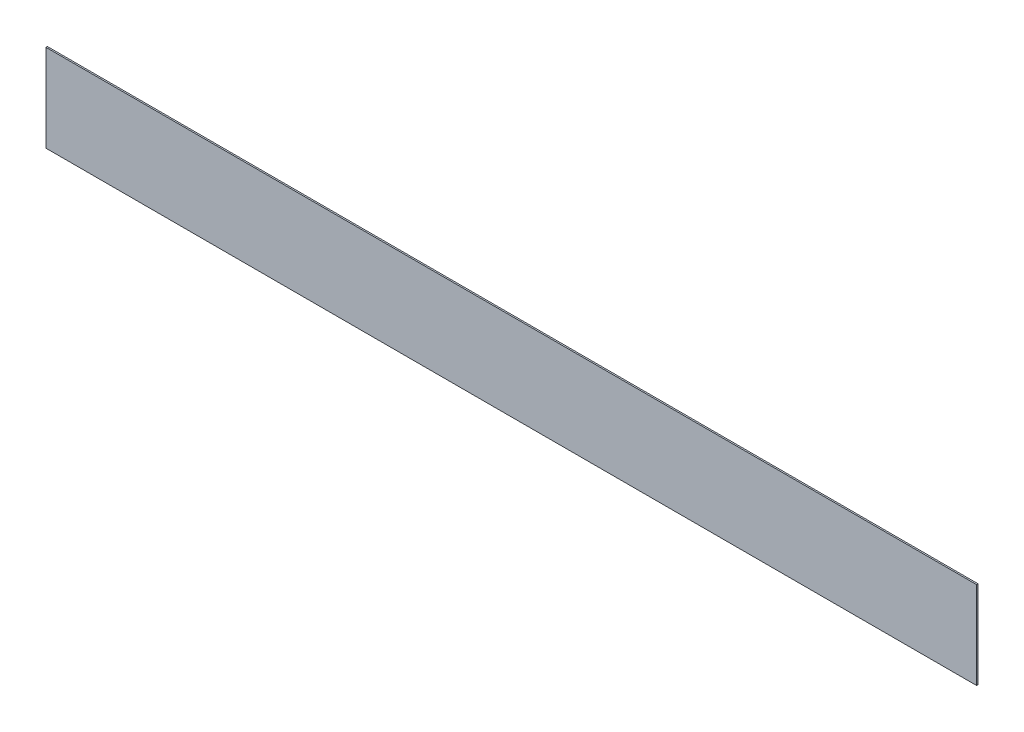
ISO-10303-21;
HEADER;
FILE_DESCRIPTION(('STEP AP214'),'2;1');
FILE_NAME('part.step','',(''),(''),'','','');
FILE_SCHEMA(('AUTOMOTIVE_DESIGN { 1 0 10303 214 1 1 1 1 }'));
ENDSEC;
DATA;
#1=APPLICATION_CONTEXT('core data for automotive mechanical design processes');
#2=APPLICATION_PROTOCOL_DEFINITION('international standard','automotive_design',2000,#1);
#3=PRODUCT_CONTEXT('',#1,'mechanical');
#4=PRODUCT('Part','Part','',(#3));
#5=PRODUCT_RELATED_PRODUCT_CATEGORY('part','',(#4));
#6=PRODUCT_DEFINITION_FORMATION('','',#4);
#7=PRODUCT_DEFINITION_CONTEXT('part definition',#1,'design');
#8=PRODUCT_DEFINITION('design','',#6,#7);
#9=PRODUCT_DEFINITION_SHAPE('','',#8);
#10=(LENGTH_UNIT() NAMED_UNIT(*) SI_UNIT(.MILLI.,.METRE.));
#11=(NAMED_UNIT(*) PLANE_ANGLE_UNIT() SI_UNIT($,.RADIAN.));
#12=(NAMED_UNIT(*) SI_UNIT($,.STERADIAN.) SOLID_ANGLE_UNIT());
#13=UNCERTAINTY_MEASURE_WITH_UNIT(LENGTH_MEASURE(1.E-05),#10,'distance_accuracy_value','');
#14=(GEOMETRIC_REPRESENTATION_CONTEXT(3) GLOBAL_UNCERTAINTY_ASSIGNED_CONTEXT((#13)) GLOBAL_UNIT_ASSIGNED_CONTEXT((#10,
#11,#12)) REPRESENTATION_CONTEXT('',''));
#15=CARTESIAN_POINT('',(0.,0.,0.));
#16=DIRECTION('',(0.,0.,1.));
#17=DIRECTION('',(1.,0.,0.));
#18=AXIS2_PLACEMENT_3D('',#15,#16,#17);
#19=CARTESIAN_POINT('',(0.,2.22044604925031E-13,1.99999999999961));
#20=DIRECTION('',(0.999999999999999,0.,0.));
#21=DIRECTION('',(0.,0.,-0.999999999999999));
#22=AXIS2_PLACEMENT_3D('',#19,#20,#21);
#23=PLANE('',#22);
#24=DIRECTION('',(0.,-1.,0.));
#25=VECTOR('',#24,1.);
#26=CARTESIAN_POINT('',(0.,0.,0.));
#27=LINE('',#26,#25);
#28=CARTESIAN_POINT('',(-6.66133814775094E-13,120.,-2.22044604925031E-13));
#29=VERTEX_POINT('',#28);
#30=CARTESIAN_POINT('',(0.,0.,0.));
#31=VERTEX_POINT('',#30);
#32=EDGE_CURVE('E93',#29,#31,#27,.T.);
#33=ORIENTED_EDGE('',*,*,#32,.T.);
#34=DIRECTION('',(0.,0.,-0.999999999999999));
#35=VECTOR('',#34,1.);
#36=CARTESIAN_POINT('',(0.,2.22044604925031E-13,1.99999999999961));
#37=LINE('',#36,#35);
#38=CARTESIAN_POINT('',(0.,2.22044604925031E-13,1.99999999999961));
#39=VERTEX_POINT('',#38);
#40=EDGE_CURVE('E11',#39,#31,#37,.T.);
#41=ORIENTED_EDGE('',*,*,#40,.F.);
#42=DIRECTION('',(0.,-1.,0.));
#43=VECTOR('',#42,1.);
#44=CARTESIAN_POINT('',(0.,2.22044604925031E-13,1.99999999999961));
#45=LINE('',#44,#43);
#46=CARTESIAN_POINT('',(-2.22044604925031E-13,120.,1.99999999999967));
#47=VERTEX_POINT('',#46);
#48=EDGE_CURVE('E81',#47,#39,#45,.T.);
#49=ORIENTED_EDGE('',*,*,#48,.F.);
#50=DIRECTION('',(0.,0.,-0.999999999999999));
#51=VECTOR('',#50,1.);
#52=CARTESIAN_POINT('',(-2.22044604925031E-13,120.,1.99999999999967));
#53=LINE('',#52,#51);
#54=EDGE_CURVE('E89',#47,#29,#53,.T.);
#55=ORIENTED_EDGE('',*,*,#54,.T.);
#56=EDGE_LOOP('',(#33,#41,#49,#55));
#57=FACE_BOUND('',#56,.T.);
#58=ADVANCED_FACE('F30',(#57),#23,.F.);
#59=CARTESIAN_POINT('',(0.,2.22044604925031E-13,1.99999999999961));
#60=DIRECTION('',(0.,1.,0.));
#61=DIRECTION('',(0.,0.,0.999999999999999));
#62=AXIS2_PLACEMENT_3D('',#59,#60,#61);
#63=PLANE('',#62);
#64=DIRECTION('',(0.999999999999999,0.,0.));
#65=VECTOR('',#64,1.);
#66=CARTESIAN_POINT('',(0.,0.,0.));
#67=LINE('',#66,#65);
#68=CARTESIAN_POINT('',(1278.,3.5527136788005E-12,-6.66133814775094E-13));
#69=VERTEX_POINT('',#68);
#70=EDGE_CURVE('E85',#31,#69,#67,.T.);
#71=ORIENTED_EDGE('',*,*,#70,.T.);
#72=DIRECTION('',(0.,0.,-0.999999999999999));
#73=VECTOR('',#72,1.);
#74=CARTESIAN_POINT('',(1278.,3.5527136788005E-12,1.99999999999956));
#75=LINE('',#74,#73);
#76=CARTESIAN_POINT('',(1278.,3.5527136788005E-12,1.99999999999956));
#77=VERTEX_POINT('',#76);
#78=EDGE_CURVE('E38',#77,#69,#75,.T.);
#79=ORIENTED_EDGE('',*,*,#78,.F.);
#80=DIRECTION('',(0.999999999999999,0.,0.));
#81=VECTOR('',#80,1.);
#82=CARTESIAN_POINT('',(0.,2.22044604925031E-13,1.99999999999961));
#83=LINE('',#82,#81);
#84=EDGE_CURVE('E76',#39,#77,#83,.T.);
#85=ORIENTED_EDGE('',*,*,#84,.F.);
#86=ORIENTED_EDGE('',*,*,#40,.T.);
#87=EDGE_LOOP('',(#71,#79,#85,#86));
#88=FACE_BOUND('',#87,.T.);
#89=ADVANCED_FACE('F84',(#88),#63,.F.);
#90=CARTESIAN_POINT('',(1278.,3.5527136788005E-12,1.99999999999956));
#91=DIRECTION('',(-0.999999999999999,0.,0.));
#92=DIRECTION('',(0.,0.,0.999999999999999));
#93=AXIS2_PLACEMENT_3D('',#90,#91,#92);
#94=PLANE('',#93);
#95=DIRECTION('',(0.,1.,0.));
#96=VECTOR('',#95,1.);
#97=CARTESIAN_POINT('',(1278.,3.5527136788005E-12,-6.66133814775094E-13));
#98=LINE('',#97,#96);
#99=CARTESIAN_POINT('',(1278.,120.000000000003,-4.9960036108132E-13));
#100=VERTEX_POINT('',#99);
#101=EDGE_CURVE('E63',#69,#100,#98,.T.);
#102=ORIENTED_EDGE('',*,*,#101,.T.);
#103=DIRECTION('',(0.,0.,-0.999999999999999));
#104=VECTOR('',#103,1.);
#105=CARTESIAN_POINT('',(1278.,120.000000000003,2.00000000000017));
#106=LINE('',#105,#104);
#107=CARTESIAN_POINT('',(1278.,120.000000000003,2.00000000000017));
#108=VERTEX_POINT('',#107);
#109=EDGE_CURVE('E86',#108,#100,#106,.T.);
#110=ORIENTED_EDGE('',*,*,#109,.F.);
#111=DIRECTION('',(0.,1.,0.));
#112=VECTOR('',#111,1.);
#113=CARTESIAN_POINT('',(1278.,3.5527136788005E-12,1.99999999999956));
#114=LINE('',#113,#112);
#115=EDGE_CURVE('E79',#77,#108,#114,.T.);
#116=ORIENTED_EDGE('',*,*,#115,.F.);
#117=ORIENTED_EDGE('',*,*,#78,.T.);
#118=EDGE_LOOP('',(#102,#110,#116,#117));
#119=FACE_BOUND('',#118,.T.);
#120=ADVANCED_FACE('F87',(#119),#94,.F.);
#121=CARTESIAN_POINT('',(-2.22044604925031E-13,120.,1.99999999999967));
#122=DIRECTION('',(0.,-1.,0.));
#123=DIRECTION('',(0.,0.,-0.999999999999999));
#124=AXIS2_PLACEMENT_3D('',#121,#122,#123);
#125=PLANE('',#124);
#126=DIRECTION('',(-0.999999999999999,0.,0.));
#127=VECTOR('',#126,1.);
#128=CARTESIAN_POINT('',(-6.66133814775094E-13,120.,-2.22044604925031E-13));
#129=LINE('',#128,#127);
#130=EDGE_CURVE('E69',#100,#29,#129,.T.);
#131=ORIENTED_EDGE('',*,*,#130,.T.);
#132=ORIENTED_EDGE('',*,*,#54,.F.);
#133=DIRECTION('',(-0.999999999999999,0.,0.));
#134=VECTOR('',#133,1.);
#135=CARTESIAN_POINT('',(-2.22044604925031E-13,120.,1.99999999999967));
#136=LINE('',#135,#134);
#137=EDGE_CURVE('E46',#108,#47,#136,.T.);
#138=ORIENTED_EDGE('',*,*,#137,.F.);
#139=ORIENTED_EDGE('',*,*,#109,.T.);
#140=EDGE_LOOP('',(#131,#132,#138,#139));
#141=FACE_BOUND('',#140,.T.);
#142=ADVANCED_FACE('F100',(#141),#125,.F.);
#143=CARTESIAN_POINT('',(0.,2.22044604925031E-13,1.99999999999961));
#144=DIRECTION('',(0.,0.,-0.999999999999999));
#145=DIRECTION('',(-0.999999999999999,0.,0.));
#146=AXIS2_PLACEMENT_3D('',#143,#144,#145);
#147=PLANE('',#146);
#148=ORIENTED_EDGE('',*,*,#48,.T.);
#149=ORIENTED_EDGE('',*,*,#84,.T.);
#150=ORIENTED_EDGE('',*,*,#115,.T.);
#151=ORIENTED_EDGE('',*,*,#137,.T.);
#152=EDGE_LOOP('',(#148,#149,#150,#151));
#153=FACE_BOUND('',#152,.T.);
#154=ADVANCED_FACE('F77',(#153),#147,.F.);
#155=CARTESIAN_POINT('',(0.,0.,0.));
#156=DIRECTION('',(0.,0.,-0.999999999999999));
#157=DIRECTION('',(-0.999999999999999,0.,0.));
#158=AXIS2_PLACEMENT_3D('',#155,#156,#157);
#159=PLANE('',#158);
#160=ORIENTED_EDGE('',*,*,#32,.F.);
#161=ORIENTED_EDGE('',*,*,#130,.F.);
#162=ORIENTED_EDGE('',*,*,#101,.F.);
#163=ORIENTED_EDGE('',*,*,#70,.F.);
#164=EDGE_LOOP('',(#160,#161,#162,#163));
#165=FACE_BOUND('',#164,.T.);
#166=ADVANCED_FACE('F103',(#165),#159,.T.);
#167=CLOSED_SHELL('',(#58,#89,#120,#142,#154,#166));
#168=MANIFOLD_SOLID_BREP('B2',#167);
#169=ADVANCED_BREP_SHAPE_REPRESENTATION('',(#18,#168),#14);
#170=SHAPE_DEFINITION_REPRESENTATION(#9,#169);
ENDSEC;
END-ISO-10303-21;
